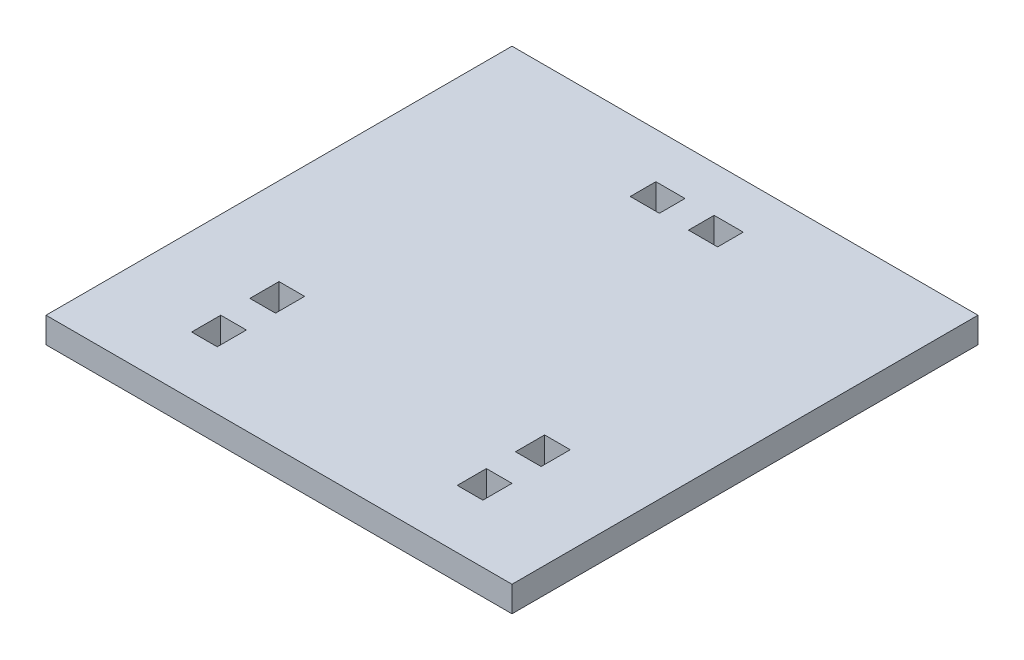
ISO-10303-21;
HEADER;
FILE_DESCRIPTION(('STEP AP214'),'2;1');
FILE_NAME('part.step','',(''),(''),'','','');
FILE_SCHEMA(('AUTOMOTIVE_DESIGN { 1 0 10303 214 1 1 1 1 }'));
ENDSEC;
DATA;
#1=APPLICATION_CONTEXT('core data for automotive mechanical design processes');
#2=APPLICATION_PROTOCOL_DEFINITION('international standard','automotive_design',2000,#1);
#3=PRODUCT_CONTEXT('',#1,'mechanical');
#4=PRODUCT('Part','Part','',(#3));
#5=PRODUCT_RELATED_PRODUCT_CATEGORY('part','',(#4));
#6=PRODUCT_DEFINITION_FORMATION('','',#4);
#7=PRODUCT_DEFINITION_CONTEXT('part definition',#1,'design');
#8=PRODUCT_DEFINITION('design','',#6,#7);
#9=PRODUCT_DEFINITION_SHAPE('','',#8);
#10=(LENGTH_UNIT() NAMED_UNIT(*) SI_UNIT(.MILLI.,.METRE.));
#11=(NAMED_UNIT(*) PLANE_ANGLE_UNIT() SI_UNIT($,.RADIAN.));
#12=(NAMED_UNIT(*) SI_UNIT($,.STERADIAN.) SOLID_ANGLE_UNIT());
#13=UNCERTAINTY_MEASURE_WITH_UNIT(LENGTH_MEASURE(1.E-05),#10,'distance_accuracy_value','');
#14=(GEOMETRIC_REPRESENTATION_CONTEXT(3) GLOBAL_UNCERTAINTY_ASSIGNED_CONTEXT((#13)) GLOBAL_UNIT_ASSIGNED_CONTEXT((#10,
#11,#12)) REPRESENTATION_CONTEXT('',''));
#15=CARTESIAN_POINT('',(0.,0.,0.));
#16=DIRECTION('',(0.,0.,1.));
#17=DIRECTION('',(1.,0.,0.));
#18=AXIS2_PLACEMENT_3D('',#15,#16,#17);
#19=CARTESIAN_POINT('',(0.,5.588,0.));
#20=DIRECTION('',(0.,-1.,0.));
#21=DIRECTION('',(0.,0.,-1.));
#22=AXIS2_PLACEMENT_3D('',#19,#20,#21);
#23=PLANE('',#22);
#24=DIRECTION('',(-1.,0.,0.));
#25=VECTOR('',#24,1.);
#26=CARTESIAN_POINT('',(82.55,5.588,-31.75));
#27=LINE('',#26,#25);
#28=CARTESIAN_POINT('',(82.55,5.588,-31.75));
#29=VERTEX_POINT('',#28);
#30=CARTESIAN_POINT('',(76.962,5.588,-31.75));
#31=VERTEX_POINT('',#30);
#32=EDGE_CURVE('E254',#29,#31,#27,.T.);
#33=ORIENTED_EDGE('',*,*,#32,.F.);
#34=DIRECTION('',(0.,0.,-1.));
#35=VECTOR('',#34,1.);
#36=CARTESIAN_POINT('',(82.55,5.588,-31.75));
#37=LINE('',#36,#35);
#38=CARTESIAN_POINT('',(82.55,5.588,-25.4));
#39=VERTEX_POINT('',#38);
#40=EDGE_CURVE('E262',#39,#29,#37,.T.);
#41=ORIENTED_EDGE('',*,*,#40,.F.);
#42=DIRECTION('',(1.,0.,0.));
#43=VECTOR('',#42,1.);
#44=CARTESIAN_POINT('',(82.55,5.588,-25.4));
#45=LINE('',#44,#43);
#46=CARTESIAN_POINT('',(76.962,5.588,-25.4));
#47=VERTEX_POINT('',#46);
#48=EDGE_CURVE('E259',#47,#39,#45,.T.);
#49=ORIENTED_EDGE('',*,*,#48,.F.);
#50=DIRECTION('',(0.,0.,1.));
#51=VECTOR('',#50,1.);
#52=CARTESIAN_POINT('',(76.962,5.588,-31.75));
#53=LINE('',#52,#51);
#54=EDGE_CURVE('E256',#31,#47,#53,.T.);
#55=ORIENTED_EDGE('',*,*,#54,.F.);
#56=EDGE_LOOP('',(#33,#41,#49,#55));
#57=FACE_BOUND('',#56,.T.);
#58=DIRECTION('',(0.,0.,1.));
#59=VECTOR('',#58,1.);
#60=CARTESIAN_POINT('',(41.275,5.588,-86.106));
#61=LINE('',#60,#59);
#62=CARTESIAN_POINT('',(41.275,5.588,-91.694));
#63=VERTEX_POINT('',#62);
#64=CARTESIAN_POINT('',(41.275,5.588,-86.106));
#65=VERTEX_POINT('',#64);
#66=EDGE_CURVE('E316',#63,#65,#61,.T.);
#67=ORIENTED_EDGE('',*,*,#66,.F.);
#68=DIRECTION('',(-1.,0.,0.));
#69=VECTOR('',#68,1.);
#70=CARTESIAN_POINT('',(41.275,5.588,-91.694));
#71=LINE('',#70,#69);
#72=CARTESIAN_POINT('',(47.625,5.588,-91.694));
#73=VERTEX_POINT('',#72);
#74=EDGE_CURVE('E324',#73,#63,#71,.T.);
#75=ORIENTED_EDGE('',*,*,#74,.F.);
#76=DIRECTION('',(0.,0.,-1.));
#77=VECTOR('',#76,1.);
#78=CARTESIAN_POINT('',(47.625,5.588,-86.106));
#79=LINE('',#78,#77);
#80=CARTESIAN_POINT('',(47.625,5.588,-86.106));
#81=VERTEX_POINT('',#80);
#82=EDGE_CURVE('E321',#81,#73,#79,.T.);
#83=ORIENTED_EDGE('',*,*,#82,.F.);
#84=DIRECTION('',(1.,0.,0.));
#85=VECTOR('',#84,1.);
#86=CARTESIAN_POINT('',(41.275,5.588,-86.106));
#87=LINE('',#86,#85);
#88=EDGE_CURVE('E318',#65,#81,#87,.T.);
#89=ORIENTED_EDGE('',*,*,#88,.F.);
#90=EDGE_LOOP('',(#67,#75,#83,#89));
#91=FACE_BOUND('',#90,.T.);
#92=DIRECTION('',(0.,0.,1.));
#93=VECTOR('',#92,1.);
#94=CARTESIAN_POINT('',(19.05,5.588,-31.75));
#95=LINE('',#94,#93);
#96=CARTESIAN_POINT('',(19.05,5.588,-31.75));
#97=VERTEX_POINT('',#96);
#98=CARTESIAN_POINT('',(19.05,5.588,-25.4));
#99=VERTEX_POINT('',#98);
#100=EDGE_CURVE('E378',#97,#99,#95,.T.);
#101=ORIENTED_EDGE('',*,*,#100,.F.);
#102=DIRECTION('',(-1.,0.,0.));
#103=VECTOR('',#102,1.);
#104=CARTESIAN_POINT('',(19.05,5.588,-31.75));
#105=LINE('',#104,#103);
#106=CARTESIAN_POINT('',(24.638,5.588,-31.75));
#107=VERTEX_POINT('',#106);
#108=EDGE_CURVE('E386',#107,#97,#105,.T.);
#109=ORIENTED_EDGE('',*,*,#108,.F.);
#110=DIRECTION('',(0.,0.,-1.));
#111=VECTOR('',#110,1.);
#112=CARTESIAN_POINT('',(24.638,5.588,-31.75));
#113=LINE('',#112,#111);
#114=CARTESIAN_POINT('',(24.638,5.588,-25.4));
#115=VERTEX_POINT('',#114);
#116=EDGE_CURVE('E383',#115,#107,#113,.T.);
#117=ORIENTED_EDGE('',*,*,#116,.F.);
#118=DIRECTION('',(1.,0.,0.));
#119=VECTOR('',#118,1.);
#120=CARTESIAN_POINT('',(19.05,5.588,-25.4));
#121=LINE('',#120,#119);
#122=EDGE_CURVE('E380',#99,#115,#121,.T.);
#123=ORIENTED_EDGE('',*,*,#122,.F.);
#124=EDGE_LOOP('',(#101,#109,#117,#123));
#125=FACE_BOUND('',#124,.T.);
#126=DIRECTION('',(0.,0.,1.));
#127=VECTOR('',#126,1.);
#128=CARTESIAN_POINT('',(0.,5.588,0.));
#129=LINE('',#128,#127);
#130=CARTESIAN_POINT('',(0.,5.588,-101.6));
#131=VERTEX_POINT('',#130);
#132=CARTESIAN_POINT('',(0.,5.588,0.));
#133=VERTEX_POINT('',#132);
#134=EDGE_CURVE('E409',#131,#133,#129,.T.);
#135=ORIENTED_EDGE('',*,*,#134,.T.);
#136=DIRECTION('',(1.,0.,0.));
#137=VECTOR('',#136,1.);
#138=CARTESIAN_POINT('',(0.,5.588,0.));
#139=LINE('',#138,#137);
#140=CARTESIAN_POINT('',(101.6,5.588,0.));
#141=VERTEX_POINT('',#140);
#142=EDGE_CURVE('E412',#133,#141,#139,.T.);
#143=ORIENTED_EDGE('',*,*,#142,.T.);
#144=DIRECTION('',(0.,0.,-1.));
#145=VECTOR('',#144,1.);
#146=CARTESIAN_POINT('',(101.6,5.588,0.));
#147=LINE('',#146,#145);
#148=CARTESIAN_POINT('',(101.6,5.588,-101.6));
#149=VERTEX_POINT('',#148);
#150=EDGE_CURVE('E415',#141,#149,#147,.T.);
#151=ORIENTED_EDGE('',*,*,#150,.T.);
#152=DIRECTION('',(-1.,0.,0.));
#153=VECTOR('',#152,1.);
#154=CARTESIAN_POINT('',(0.,5.588,-101.6));
#155=LINE('',#154,#153);
#156=EDGE_CURVE('E417',#149,#131,#155,.T.);
#157=ORIENTED_EDGE('',*,*,#156,.T.);
#158=EDGE_LOOP('',(#135,#143,#151,#157));
#159=FACE_BOUND('',#158,.T.);
#160=DIRECTION('',(0.,0.,1.));
#161=VECTOR('',#160,1.);
#162=CARTESIAN_POINT('',(19.05,5.588,-19.05));
#163=LINE('',#162,#161);
#164=CARTESIAN_POINT('',(19.05,5.588,-19.05));
#165=VERTEX_POINT('',#164);
#166=CARTESIAN_POINT('',(19.05,5.588,-12.7));
#167=VERTEX_POINT('',#166);
#168=EDGE_CURVE('E347',#165,#167,#163,.T.);
#169=ORIENTED_EDGE('',*,*,#168,.F.);
#170=DIRECTION('',(-1.,0.,0.));
#171=VECTOR('',#170,1.);
#172=CARTESIAN_POINT('',(19.05,5.588,-19.05));
#173=LINE('',#172,#171);
#174=CARTESIAN_POINT('',(24.638,5.588,-19.05));
#175=VERTEX_POINT('',#174);
#176=EDGE_CURVE('E355',#175,#165,#173,.T.);
#177=ORIENTED_EDGE('',*,*,#176,.F.);
#178=DIRECTION('',(0.,0.,-1.));
#179=VECTOR('',#178,1.);
#180=CARTESIAN_POINT('',(24.638,5.588,-19.05));
#181=LINE('',#180,#179);
#182=CARTESIAN_POINT('',(24.638,5.588,-12.7));
#183=VERTEX_POINT('',#182);
#184=EDGE_CURVE('E352',#183,#175,#181,.T.);
#185=ORIENTED_EDGE('',*,*,#184,.F.);
#186=DIRECTION('',(1.,0.,0.));
#187=VECTOR('',#186,1.);
#188=CARTESIAN_POINT('',(19.05,5.588,-12.7));
#189=LINE('',#188,#187);
#190=EDGE_CURVE('E349',#167,#183,#189,.T.);
#191=ORIENTED_EDGE('',*,*,#190,.F.);
#192=EDGE_LOOP('',(#169,#177,#185,#191));
#193=FACE_BOUND('',#192,.T.);
#194=DIRECTION('',(-1.,0.,0.));
#195=VECTOR('',#194,1.);
#196=CARTESIAN_POINT('',(82.55,5.588,-19.05));
#197=LINE('',#196,#195);
#198=CARTESIAN_POINT('',(82.55,5.588,-19.05));
#199=VERTEX_POINT('',#198);
#200=CARTESIAN_POINT('',(76.962,5.588,-19.05));
#201=VERTEX_POINT('',#200);
#202=EDGE_CURVE('E285',#199,#201,#197,.T.);
#203=ORIENTED_EDGE('',*,*,#202,.F.);
#204=DIRECTION('',(0.,0.,-1.));
#205=VECTOR('',#204,1.);
#206=CARTESIAN_POINT('',(82.55,5.588,-19.05));
#207=LINE('',#206,#205);
#208=CARTESIAN_POINT('',(82.55,5.588,-12.7));
#209=VERTEX_POINT('',#208);
#210=EDGE_CURVE('E293',#209,#199,#207,.T.);
#211=ORIENTED_EDGE('',*,*,#210,.F.);
#212=DIRECTION('',(1.,0.,0.));
#213=VECTOR('',#212,1.);
#214=CARTESIAN_POINT('',(82.55,5.588,-12.7));
#215=LINE('',#214,#213);
#216=CARTESIAN_POINT('',(76.962,5.588,-12.7));
#217=VERTEX_POINT('',#216);
#218=EDGE_CURVE('E290',#217,#209,#215,.T.);
#219=ORIENTED_EDGE('',*,*,#218,.F.);
#220=DIRECTION('',(0.,0.,1.));
#221=VECTOR('',#220,1.);
#222=CARTESIAN_POINT('',(76.962,5.588,-19.05));
#223=LINE('',#222,#221);
#224=EDGE_CURVE('E287',#201,#217,#223,.T.);
#225=ORIENTED_EDGE('',*,*,#224,.F.);
#226=EDGE_LOOP('',(#203,#211,#219,#225));
#227=FACE_BOUND('',#226,.T.);
#228=DIRECTION('',(0.,0.,1.));
#229=VECTOR('',#228,1.);
#230=CARTESIAN_POINT('',(53.975,5.588,-86.106));
#231=LINE('',#230,#229);
#232=CARTESIAN_POINT('',(53.975,5.588,-91.694));
#233=VERTEX_POINT('',#232);
#234=CARTESIAN_POINT('',(53.975,5.588,-86.106));
#235=VERTEX_POINT('',#234);
#236=EDGE_CURVE('E218',#233,#235,#231,.T.);
#237=ORIENTED_EDGE('',*,*,#236,.F.);
#238=DIRECTION('',(-1.,0.,0.));
#239=VECTOR('',#238,1.);
#240=CARTESIAN_POINT('',(53.975,5.588,-91.694));
#241=LINE('',#240,#239);
#242=CARTESIAN_POINT('',(60.325,5.588,-91.694));
#243=VERTEX_POINT('',#242);
#244=EDGE_CURVE('E240',#243,#233,#241,.T.);
#245=ORIENTED_EDGE('',*,*,#244,.F.);
#246=DIRECTION('',(0.,0.,-1.));
#247=VECTOR('',#246,1.);
#248=CARTESIAN_POINT('',(60.325,5.588,-86.106));
#249=LINE('',#248,#247);
#250=CARTESIAN_POINT('',(60.325,5.588,-86.106));
#251=VERTEX_POINT('',#250);
#252=EDGE_CURVE('E238',#251,#243,#249,.T.);
#253=ORIENTED_EDGE('',*,*,#252,.F.);
#254=DIRECTION('',(1.,0.,0.));
#255=VECTOR('',#254,1.);
#256=CARTESIAN_POINT('',(53.975,5.588,-86.106));
#257=LINE('',#256,#255);
#258=EDGE_CURVE('E226',#235,#251,#257,.T.);
#259=ORIENTED_EDGE('',*,*,#258,.F.);
#260=EDGE_LOOP('',(#237,#245,#253,#259));
#261=FACE_BOUND('',#260,.T.);
#262=ADVANCED_FACE('F33',(#57,#91,#125,#159,#193,#227,#261),#23,.F.);
#263=CARTESIAN_POINT('',(0.,0.,0.));
#264=DIRECTION('',(0.,-1.,0.));
#265=DIRECTION('',(0.,0.,-1.));
#266=AXIS2_PLACEMENT_3D('',#263,#264,#265);
#267=PLANE('',#266);
#268=DIRECTION('',(0.,0.,1.));
#269=VECTOR('',#268,1.);
#270=CARTESIAN_POINT('',(0.,0.,0.));
#271=LINE('',#270,#269);
#272=CARTESIAN_POINT('',(0.,0.,-101.6));
#273=VERTEX_POINT('',#272);
#274=CARTESIAN_POINT('',(0.,0.,0.));
#275=VERTEX_POINT('',#274);
#276=EDGE_CURVE('E408',#273,#275,#271,.T.);
#277=ORIENTED_EDGE('',*,*,#276,.F.);
#278=DIRECTION('',(-1.,0.,0.));
#279=VECTOR('',#278,1.);
#280=CARTESIAN_POINT('',(0.,0.,-101.6));
#281=LINE('',#280,#279);
#282=CARTESIAN_POINT('',(101.6,0.,-101.6));
#283=VERTEX_POINT('',#282);
#284=EDGE_CURVE('E413',#283,#273,#281,.T.);
#285=ORIENTED_EDGE('',*,*,#284,.F.);
#286=DIRECTION('',(0.,0.,-1.));
#287=VECTOR('',#286,1.);
#288=CARTESIAN_POINT('',(101.6,0.,0.));
#289=LINE('',#288,#287);
#290=CARTESIAN_POINT('',(101.6,0.,0.));
#291=VERTEX_POINT('',#290);
#292=EDGE_CURVE('E424',#291,#283,#289,.T.);
#293=ORIENTED_EDGE('',*,*,#292,.F.);
#294=DIRECTION('',(1.,0.,0.));
#295=VECTOR('',#294,1.);
#296=CARTESIAN_POINT('',(0.,0.,0.));
#297=LINE('',#296,#295);
#298=EDGE_CURVE('E422',#275,#291,#297,.T.);
#299=ORIENTED_EDGE('',*,*,#298,.F.);
#300=EDGE_LOOP('',(#277,#285,#293,#299));
#301=FACE_BOUND('',#300,.T.);
#302=DIRECTION('',(-1.,0.,0.));
#303=VECTOR('',#302,1.);
#304=CARTESIAN_POINT('',(19.05,0.,-31.75));
#305=LINE('',#304,#303);
#306=CARTESIAN_POINT('',(24.638,0.,-31.75));
#307=VERTEX_POINT('',#306);
#308=CARTESIAN_POINT('',(19.05,0.,-31.75));
#309=VERTEX_POINT('',#308);
#310=EDGE_CURVE('E381',#307,#309,#305,.T.);
#311=ORIENTED_EDGE('',*,*,#310,.T.);
#312=DIRECTION('',(0.,0.,1.));
#313=VECTOR('',#312,1.);
#314=CARTESIAN_POINT('',(19.05,0.,-31.75));
#315=LINE('',#314,#313);
#316=CARTESIAN_POINT('',(19.05,0.,-25.4));
#317=VERTEX_POINT('',#316);
#318=EDGE_CURVE('E377',#309,#317,#315,.T.);
#319=ORIENTED_EDGE('',*,*,#318,.T.);
#320=DIRECTION('',(1.,0.,0.));
#321=VECTOR('',#320,1.);
#322=CARTESIAN_POINT('',(19.05,0.,-25.4));
#323=LINE('',#322,#321);
#324=CARTESIAN_POINT('',(24.638,0.,-25.4));
#325=VERTEX_POINT('',#324);
#326=EDGE_CURVE('E391',#317,#325,#323,.T.);
#327=ORIENTED_EDGE('',*,*,#326,.T.);
#328=DIRECTION('',(0.,0.,-1.));
#329=VECTOR('',#328,1.);
#330=CARTESIAN_POINT('',(24.638,0.,-31.75));
#331=LINE('',#330,#329);
#332=EDGE_CURVE('E394',#325,#307,#331,.T.);
#333=ORIENTED_EDGE('',*,*,#332,.T.);
#334=EDGE_LOOP('',(#311,#319,#327,#333));
#335=FACE_BOUND('',#334,.T.);
#336=DIRECTION('',(-1.,0.,0.));
#337=VECTOR('',#336,1.);
#338=CARTESIAN_POINT('',(19.05,0.,-19.05));
#339=LINE('',#338,#337);
#340=CARTESIAN_POINT('',(24.638,0.,-19.05));
#341=VERTEX_POINT('',#340);
#342=CARTESIAN_POINT('',(19.05,0.,-19.05));
#343=VERTEX_POINT('',#342);
#344=EDGE_CURVE('E350',#341,#343,#339,.T.);
#345=ORIENTED_EDGE('',*,*,#344,.T.);
#346=DIRECTION('',(0.,0.,1.));
#347=VECTOR('',#346,1.);
#348=CARTESIAN_POINT('',(19.05,0.,-19.05));
#349=LINE('',#348,#347);
#350=CARTESIAN_POINT('',(19.05,0.,-12.7));
#351=VERTEX_POINT('',#350);
#352=EDGE_CURVE('E346',#343,#351,#349,.T.);
#353=ORIENTED_EDGE('',*,*,#352,.T.);
#354=DIRECTION('',(1.,0.,0.));
#355=VECTOR('',#354,1.);
#356=CARTESIAN_POINT('',(19.05,0.,-12.7));
#357=LINE('',#356,#355);
#358=CARTESIAN_POINT('',(24.638,0.,-12.7));
#359=VERTEX_POINT('',#358);
#360=EDGE_CURVE('E360',#351,#359,#357,.T.);
#361=ORIENTED_EDGE('',*,*,#360,.T.);
#362=DIRECTION('',(0.,0.,-1.));
#363=VECTOR('',#362,1.);
#364=CARTESIAN_POINT('',(24.638,0.,-19.05));
#365=LINE('',#364,#363);
#366=EDGE_CURVE('E363',#359,#341,#365,.T.);
#367=ORIENTED_EDGE('',*,*,#366,.T.);
#368=EDGE_LOOP('',(#345,#353,#361,#367));
#369=FACE_BOUND('',#368,.T.);
#370=DIRECTION('',(-1.,0.,0.));
#371=VECTOR('',#370,1.);
#372=CARTESIAN_POINT('',(41.275,0.,-91.694));
#373=LINE('',#372,#371);
#374=CARTESIAN_POINT('',(47.625,0.,-91.694));
#375=VERTEX_POINT('',#374);
#376=CARTESIAN_POINT('',(41.275,0.,-91.694));
#377=VERTEX_POINT('',#376);
#378=EDGE_CURVE('E319',#375,#377,#373,.T.);
#379=ORIENTED_EDGE('',*,*,#378,.T.);
#380=DIRECTION('',(0.,0.,1.));
#381=VECTOR('',#380,1.);
#382=CARTESIAN_POINT('',(41.275,0.,-86.106));
#383=LINE('',#382,#381);
#384=CARTESIAN_POINT('',(41.275,0.,-86.106));
#385=VERTEX_POINT('',#384);
#386=EDGE_CURVE('E315',#377,#385,#383,.T.);
#387=ORIENTED_EDGE('',*,*,#386,.T.);
#388=DIRECTION('',(1.,0.,0.));
#389=VECTOR('',#388,1.);
#390=CARTESIAN_POINT('',(41.275,0.,-86.106));
#391=LINE('',#390,#389);
#392=CARTESIAN_POINT('',(47.625,0.,-86.106));
#393=VERTEX_POINT('',#392);
#394=EDGE_CURVE('E329',#385,#393,#391,.T.);
#395=ORIENTED_EDGE('',*,*,#394,.T.);
#396=DIRECTION('',(0.,0.,-1.));
#397=VECTOR('',#396,1.);
#398=CARTESIAN_POINT('',(47.625,0.,-86.106));
#399=LINE('',#398,#397);
#400=EDGE_CURVE('E332',#393,#375,#399,.T.);
#401=ORIENTED_EDGE('',*,*,#400,.T.);
#402=EDGE_LOOP('',(#379,#387,#395,#401));
#403=FACE_BOUND('',#402,.T.);
#404=DIRECTION('',(0.,0.,-1.));
#405=VECTOR('',#404,1.);
#406=CARTESIAN_POINT('',(82.55,0.,-19.05));
#407=LINE('',#406,#405);
#408=CARTESIAN_POINT('',(82.55,0.,-12.7));
#409=VERTEX_POINT('',#408);
#410=CARTESIAN_POINT('',(82.55,0.,-19.05));
#411=VERTEX_POINT('',#410);
#412=EDGE_CURVE('E288',#409,#411,#407,.T.);
#413=ORIENTED_EDGE('',*,*,#412,.T.);
#414=DIRECTION('',(-1.,0.,0.));
#415=VECTOR('',#414,1.);
#416=CARTESIAN_POINT('',(82.55,0.,-19.05));
#417=LINE('',#416,#415);
#418=CARTESIAN_POINT('',(76.962,0.,-19.05));
#419=VERTEX_POINT('',#418);
#420=EDGE_CURVE('E284',#411,#419,#417,.T.);
#421=ORIENTED_EDGE('',*,*,#420,.T.);
#422=DIRECTION('',(0.,0.,1.));
#423=VECTOR('',#422,1.);
#424=CARTESIAN_POINT('',(76.962,0.,-19.05));
#425=LINE('',#424,#423);
#426=CARTESIAN_POINT('',(76.962,0.,-12.7));
#427=VERTEX_POINT('',#426);
#428=EDGE_CURVE('E298',#419,#427,#425,.T.);
#429=ORIENTED_EDGE('',*,*,#428,.T.);
#430=DIRECTION('',(1.,0.,0.));
#431=VECTOR('',#430,1.);
#432=CARTESIAN_POINT('',(82.55,0.,-12.7));
#433=LINE('',#432,#431);
#434=EDGE_CURVE('E301',#427,#409,#433,.T.);
#435=ORIENTED_EDGE('',*,*,#434,.T.);
#436=EDGE_LOOP('',(#413,#421,#429,#435));
#437=FACE_BOUND('',#436,.T.);
#438=DIRECTION('',(0.,0.,-1.));
#439=VECTOR('',#438,1.);
#440=CARTESIAN_POINT('',(82.55,0.,-31.75));
#441=LINE('',#440,#439);
#442=CARTESIAN_POINT('',(82.55,0.,-25.4));
#443=VERTEX_POINT('',#442);
#444=CARTESIAN_POINT('',(82.55,0.,-31.75));
#445=VERTEX_POINT('',#444);
#446=EDGE_CURVE('E257',#443,#445,#441,.T.);
#447=ORIENTED_EDGE('',*,*,#446,.T.);
#448=DIRECTION('',(-1.,0.,0.));
#449=VECTOR('',#448,1.);
#450=CARTESIAN_POINT('',(82.55,0.,-31.75));
#451=LINE('',#450,#449);
#452=CARTESIAN_POINT('',(76.962,0.,-31.75));
#453=VERTEX_POINT('',#452);
#454=EDGE_CURVE('E234',#445,#453,#451,.T.);
#455=ORIENTED_EDGE('',*,*,#454,.T.);
#456=DIRECTION('',(0.,0.,1.));
#457=VECTOR('',#456,1.);
#458=CARTESIAN_POINT('',(76.962,0.,-31.75));
#459=LINE('',#458,#457);
#460=CARTESIAN_POINT('',(76.962,0.,-25.4));
#461=VERTEX_POINT('',#460);
#462=EDGE_CURVE('E267',#453,#461,#459,.T.);
#463=ORIENTED_EDGE('',*,*,#462,.T.);
#464=DIRECTION('',(1.,0.,0.));
#465=VECTOR('',#464,1.);
#466=CARTESIAN_POINT('',(82.55,0.,-25.4));
#467=LINE('',#466,#465);
#468=EDGE_CURVE('E270',#461,#443,#467,.T.);
#469=ORIENTED_EDGE('',*,*,#468,.T.);
#470=EDGE_LOOP('',(#447,#455,#463,#469));
#471=FACE_BOUND('',#470,.T.);
#472=DIRECTION('',(-1.,0.,0.));
#473=VECTOR('',#472,1.);
#474=CARTESIAN_POINT('',(53.975,0.,-91.694));
#475=LINE('',#474,#473);
#476=CARTESIAN_POINT('',(60.325,0.,-91.694));
#477=VERTEX_POINT('',#476);
#478=CARTESIAN_POINT('',(53.975,0.,-91.694));
#479=VERTEX_POINT('',#478);
#480=EDGE_CURVE('E227',#477,#479,#475,.T.);
#481=ORIENTED_EDGE('',*,*,#480,.T.);
#482=DIRECTION('',(0.,0.,1.));
#483=VECTOR('',#482,1.);
#484=CARTESIAN_POINT('',(53.975,0.,-86.106));
#485=LINE('',#484,#483);
#486=CARTESIAN_POINT('',(53.975,0.,-86.106));
#487=VERTEX_POINT('',#486);
#488=EDGE_CURVE('E56',#479,#487,#485,.T.);
#489=ORIENTED_EDGE('',*,*,#488,.T.);
#490=DIRECTION('',(1.,0.,0.));
#491=VECTOR('',#490,1.);
#492=CARTESIAN_POINT('',(53.975,0.,-86.106));
#493=LINE('',#492,#491);
#494=CARTESIAN_POINT('',(60.325,0.,-86.106));
#495=VERTEX_POINT('',#494);
#496=EDGE_CURVE('E233',#487,#495,#493,.T.);
#497=ORIENTED_EDGE('',*,*,#496,.T.);
#498=DIRECTION('',(0.,0.,-1.));
#499=VECTOR('',#498,1.);
#500=CARTESIAN_POINT('',(60.325,0.,-86.106));
#501=LINE('',#500,#499);
#502=EDGE_CURVE('E246',#495,#477,#501,.T.);
#503=ORIENTED_EDGE('',*,*,#502,.T.);
#504=EDGE_LOOP('',(#481,#489,#497,#503));
#505=FACE_BOUND('',#504,.T.);
#506=ADVANCED_FACE('F442',(#301,#335,#369,#403,#437,#471,#505),#267,.T.);
#507=CARTESIAN_POINT('',(0.,5.588,0.));
#508=DIRECTION('',(1.,0.,0.));
#509=DIRECTION('',(0.,0.,-1.));
#510=AXIS2_PLACEMENT_3D('',#507,#508,#509);
#511=PLANE('',#510);
#512=ORIENTED_EDGE('',*,*,#276,.T.);
#513=DIRECTION('',(0.,-1.,0.));
#514=VECTOR('',#513,1.);
#515=CARTESIAN_POINT('',(0.,5.588,0.));
#516=LINE('',#515,#514);
#517=EDGE_CURVE('E11',#133,#275,#516,.T.);
#518=ORIENTED_EDGE('',*,*,#517,.F.);
#519=ORIENTED_EDGE('',*,*,#134,.F.);
#520=DIRECTION('',(0.,-1.,0.));
#521=VECTOR('',#520,1.);
#522=CARTESIAN_POINT('',(0.,5.588,-101.6));
#523=LINE('',#522,#521);
#524=EDGE_CURVE('E419',#131,#273,#523,.T.);
#525=ORIENTED_EDGE('',*,*,#524,.T.);
#526=EDGE_LOOP('',(#512,#518,#519,#525));
#527=FACE_BOUND('',#526,.T.);
#528=ADVANCED_FACE('F35',(#527),#511,.F.);
#529=CARTESIAN_POINT('',(0.,5.588,0.));
#530=DIRECTION('',(0.,0.,-1.));
#531=DIRECTION('',(-1.,0.,0.));
#532=AXIS2_PLACEMENT_3D('',#529,#530,#531);
#533=PLANE('',#532);
#534=ORIENTED_EDGE('',*,*,#298,.T.);
#535=DIRECTION('',(0.,-1.,0.));
#536=VECTOR('',#535,1.);
#537=CARTESIAN_POINT('',(101.6,5.588,0.));
#538=LINE('',#537,#536);
#539=EDGE_CURVE('E41',#141,#291,#538,.T.);
#540=ORIENTED_EDGE('',*,*,#539,.F.);
#541=ORIENTED_EDGE('',*,*,#142,.F.);
#542=ORIENTED_EDGE('',*,*,#517,.T.);
#543=EDGE_LOOP('',(#534,#540,#541,#542));
#544=FACE_BOUND('',#543,.T.);
#545=ADVANCED_FACE('F453',(#544),#533,.F.);
#546=CARTESIAN_POINT('',(101.6,5.588,0.));
#547=DIRECTION('',(-1.,0.,0.));
#548=DIRECTION('',(0.,0.,1.));
#549=AXIS2_PLACEMENT_3D('',#546,#547,#548);
#550=PLANE('',#549);
#551=ORIENTED_EDGE('',*,*,#292,.T.);
#552=DIRECTION('',(0.,-1.,0.));
#553=VECTOR('',#552,1.);
#554=CARTESIAN_POINT('',(101.6,5.588,-101.6));
#555=LINE('',#554,#553);
#556=EDGE_CURVE('E429',#149,#283,#555,.T.);
#557=ORIENTED_EDGE('',*,*,#556,.F.);
#558=ORIENTED_EDGE('',*,*,#150,.F.);
#559=ORIENTED_EDGE('',*,*,#539,.T.);
#560=EDGE_LOOP('',(#551,#557,#558,#559));
#561=FACE_BOUND('',#560,.T.);
#562=ADVANCED_FACE('F436',(#561),#550,.F.);
#563=CARTESIAN_POINT('',(0.,5.588,-101.6));
#564=DIRECTION('',(0.,0.,1.));
#565=DIRECTION('',(1.,0.,0.));
#566=AXIS2_PLACEMENT_3D('',#563,#564,#565);
#567=PLANE('',#566);
#568=ORIENTED_EDGE('',*,*,#284,.T.);
#569=ORIENTED_EDGE('',*,*,#524,.F.);
#570=ORIENTED_EDGE('',*,*,#156,.F.);
#571=ORIENTED_EDGE('',*,*,#556,.T.);
#572=EDGE_LOOP('',(#568,#569,#570,#571));
#573=FACE_BOUND('',#572,.T.);
#574=ADVANCED_FACE('F446',(#573),#567,.F.);
#575=CARTESIAN_POINT('',(19.05,5.588,-31.75));
#576=DIRECTION('',(1.,0.,0.));
#577=DIRECTION('',(0.,0.,-1.));
#578=AXIS2_PLACEMENT_3D('',#575,#576,#577);
#579=PLANE('',#578);
#580=ORIENTED_EDGE('',*,*,#318,.F.);
#581=DIRECTION('',(0.,-1.,0.));
#582=VECTOR('',#581,1.);
#583=CARTESIAN_POINT('',(19.05,5.588,-31.75));
#584=LINE('',#583,#582);
#585=EDGE_CURVE('E388',#97,#309,#584,.T.);
#586=ORIENTED_EDGE('',*,*,#585,.F.);
#587=ORIENTED_EDGE('',*,*,#100,.T.);
#588=DIRECTION('',(0.,-1.,0.));
#589=VECTOR('',#588,1.);
#590=CARTESIAN_POINT('',(19.05,5.588,-25.4));
#591=LINE('',#590,#589);
#592=EDGE_CURVE('E405',#99,#317,#591,.T.);
#593=ORIENTED_EDGE('',*,*,#592,.T.);
#594=EDGE_LOOP('',(#580,#586,#587,#593));
#595=FACE_BOUND('',#594,.T.);
#596=ADVANCED_FACE('F470',(#595),#579,.T.);
#597=CARTESIAN_POINT('',(19.05,5.588,-25.4));
#598=DIRECTION('',(0.,0.,-1.));
#599=DIRECTION('',(-1.,0.,0.));
#600=AXIS2_PLACEMENT_3D('',#597,#598,#599);
#601=PLANE('',#600);
#602=ORIENTED_EDGE('',*,*,#326,.F.);
#603=ORIENTED_EDGE('',*,*,#592,.F.);
#604=ORIENTED_EDGE('',*,*,#122,.T.);
#605=DIRECTION('',(0.,-1.,0.));
#606=VECTOR('',#605,1.);
#607=CARTESIAN_POINT('',(24.638,5.588,-25.4));
#608=LINE('',#607,#606);
#609=EDGE_CURVE('E403',#115,#325,#608,.T.);
#610=ORIENTED_EDGE('',*,*,#609,.T.);
#611=EDGE_LOOP('',(#602,#603,#604,#610));
#612=FACE_BOUND('',#611,.T.);
#613=ADVANCED_FACE('F477',(#612),#601,.T.);
#614=CARTESIAN_POINT('',(24.638,5.588,-31.75));
#615=DIRECTION('',(-1.,0.,0.));
#616=DIRECTION('',(0.,0.,1.));
#617=AXIS2_PLACEMENT_3D('',#614,#615,#616);
#618=PLANE('',#617);
#619=ORIENTED_EDGE('',*,*,#332,.F.);
#620=ORIENTED_EDGE('',*,*,#609,.F.);
#621=ORIENTED_EDGE('',*,*,#116,.T.);
#622=DIRECTION('',(0.,-1.,0.));
#623=VECTOR('',#622,1.);
#624=CARTESIAN_POINT('',(24.638,5.588,-31.75));
#625=LINE('',#624,#623);
#626=EDGE_CURVE('E401',#107,#307,#625,.T.);
#627=ORIENTED_EDGE('',*,*,#626,.T.);
#628=EDGE_LOOP('',(#619,#620,#621,#627));
#629=FACE_BOUND('',#628,.T.);
#630=ADVANCED_FACE('F482',(#629),#618,.T.);
#631=CARTESIAN_POINT('',(19.05,5.588,-31.75));
#632=DIRECTION('',(0.,0.,1.));
#633=DIRECTION('',(1.,0.,0.));
#634=AXIS2_PLACEMENT_3D('',#631,#632,#633);
#635=PLANE('',#634);
#636=ORIENTED_EDGE('',*,*,#310,.F.);
#637=ORIENTED_EDGE('',*,*,#626,.F.);
#638=ORIENTED_EDGE('',*,*,#108,.T.);
#639=ORIENTED_EDGE('',*,*,#585,.T.);
#640=EDGE_LOOP('',(#636,#637,#638,#639));
#641=FACE_BOUND('',#640,.T.);
#642=ADVANCED_FACE('F489',(#641),#635,.T.);
#643=CARTESIAN_POINT('',(19.05,5.588,-19.05));
#644=DIRECTION('',(1.,0.,0.));
#645=DIRECTION('',(0.,0.,-1.));
#646=AXIS2_PLACEMENT_3D('',#643,#644,#645);
#647=PLANE('',#646);
#648=ORIENTED_EDGE('',*,*,#352,.F.);
#649=DIRECTION('',(0.,-1.,0.));
#650=VECTOR('',#649,1.);
#651=CARTESIAN_POINT('',(19.05,5.588,-19.05));
#652=LINE('',#651,#650);
#653=EDGE_CURVE('E357',#165,#343,#652,.T.);
#654=ORIENTED_EDGE('',*,*,#653,.F.);
#655=ORIENTED_EDGE('',*,*,#168,.T.);
#656=DIRECTION('',(0.,-1.,0.));
#657=VECTOR('',#656,1.);
#658=CARTESIAN_POINT('',(19.05,5.588,-12.7));
#659=LINE('',#658,#657);
#660=EDGE_CURVE('E374',#167,#351,#659,.T.);
#661=ORIENTED_EDGE('',*,*,#660,.T.);
#662=EDGE_LOOP('',(#648,#654,#655,#661));
#663=FACE_BOUND('',#662,.T.);
#664=ADVANCED_FACE('F503',(#663),#647,.T.);
#665=CARTESIAN_POINT('',(19.05,5.588,-12.7));
#666=DIRECTION('',(0.,0.,-1.));
#667=DIRECTION('',(-1.,0.,0.));
#668=AXIS2_PLACEMENT_3D('',#665,#666,#667);
#669=PLANE('',#668);
#670=ORIENTED_EDGE('',*,*,#360,.F.);
#671=ORIENTED_EDGE('',*,*,#660,.F.);
#672=ORIENTED_EDGE('',*,*,#190,.T.);
#673=DIRECTION('',(0.,-1.,0.));
#674=VECTOR('',#673,1.);
#675=CARTESIAN_POINT('',(24.638,5.588,-12.7));
#676=LINE('',#675,#674);
#677=EDGE_CURVE('E372',#183,#359,#676,.T.);
#678=ORIENTED_EDGE('',*,*,#677,.T.);
#679=EDGE_LOOP('',(#670,#671,#672,#678));
#680=FACE_BOUND('',#679,.T.);
#681=ADVANCED_FACE('F508',(#680),#669,.T.);
#682=CARTESIAN_POINT('',(24.638,5.588,-19.05));
#683=DIRECTION('',(-1.,0.,0.));
#684=DIRECTION('',(0.,0.,1.));
#685=AXIS2_PLACEMENT_3D('',#682,#683,#684);
#686=PLANE('',#685);
#687=ORIENTED_EDGE('',*,*,#366,.F.);
#688=ORIENTED_EDGE('',*,*,#677,.F.);
#689=ORIENTED_EDGE('',*,*,#184,.T.);
#690=DIRECTION('',(0.,-1.,0.));
#691=VECTOR('',#690,1.);
#692=CARTESIAN_POINT('',(24.638,5.588,-19.05));
#693=LINE('',#692,#691);
#694=EDGE_CURVE('E370',#175,#341,#693,.T.);
#695=ORIENTED_EDGE('',*,*,#694,.T.);
#696=EDGE_LOOP('',(#687,#688,#689,#695));
#697=FACE_BOUND('',#696,.T.);
#698=ADVANCED_FACE('F512',(#697),#686,.T.);
#699=CARTESIAN_POINT('',(19.05,5.588,-19.05));
#700=DIRECTION('',(0.,0.,1.));
#701=DIRECTION('',(1.,0.,0.));
#702=AXIS2_PLACEMENT_3D('',#699,#700,#701);
#703=PLANE('',#702);
#704=ORIENTED_EDGE('',*,*,#344,.F.);
#705=ORIENTED_EDGE('',*,*,#694,.F.);
#706=ORIENTED_EDGE('',*,*,#176,.T.);
#707=ORIENTED_EDGE('',*,*,#653,.T.);
#708=EDGE_LOOP('',(#704,#705,#706,#707));
#709=FACE_BOUND('',#708,.T.);
#710=ADVANCED_FACE('F516',(#709),#703,.T.);
#711=CARTESIAN_POINT('',(41.275,5.588,-86.106));
#712=DIRECTION('',(1.,0.,0.));
#713=DIRECTION('',(0.,0.,-1.));
#714=AXIS2_PLACEMENT_3D('',#711,#712,#713);
#715=PLANE('',#714);
#716=ORIENTED_EDGE('',*,*,#386,.F.);
#717=DIRECTION('',(0.,-1.,0.));
#718=VECTOR('',#717,1.);
#719=CARTESIAN_POINT('',(41.275,5.588,-91.694));
#720=LINE('',#719,#718);
#721=EDGE_CURVE('E326',#63,#377,#720,.T.);
#722=ORIENTED_EDGE('',*,*,#721,.F.);
#723=ORIENTED_EDGE('',*,*,#66,.T.);
#724=DIRECTION('',(0.,-1.,0.));
#725=VECTOR('',#724,1.);
#726=CARTESIAN_POINT('',(41.275,5.588,-86.106));
#727=LINE('',#726,#725);
#728=EDGE_CURVE('E343',#65,#385,#727,.T.);
#729=ORIENTED_EDGE('',*,*,#728,.T.);
#730=EDGE_LOOP('',(#716,#722,#723,#729));
#731=FACE_BOUND('',#730,.T.);
#732=ADVANCED_FACE('F520',(#731),#715,.T.);
#733=CARTESIAN_POINT('',(41.275,5.588,-86.106));
#734=DIRECTION('',(0.,0.,-1.));
#735=DIRECTION('',(-1.,0.,0.));
#736=AXIS2_PLACEMENT_3D('',#733,#734,#735);
#737=PLANE('',#736);
#738=ORIENTED_EDGE('',*,*,#394,.F.);
#739=ORIENTED_EDGE('',*,*,#728,.F.);
#740=ORIENTED_EDGE('',*,*,#88,.T.);
#741=DIRECTION('',(0.,-1.,0.));
#742=VECTOR('',#741,1.);
#743=CARTESIAN_POINT('',(47.625,5.588,-86.106));
#744=LINE('',#743,#742);
#745=EDGE_CURVE('E341',#81,#393,#744,.T.);
#746=ORIENTED_EDGE('',*,*,#745,.T.);
#747=EDGE_LOOP('',(#738,#739,#740,#746));
#748=FACE_BOUND('',#747,.T.);
#749=ADVANCED_FACE('F524',(#748),#737,.T.);
#750=CARTESIAN_POINT('',(47.625,5.588,-86.106));
#751=DIRECTION('',(-1.,0.,0.));
#752=DIRECTION('',(0.,0.,1.));
#753=AXIS2_PLACEMENT_3D('',#750,#751,#752);
#754=PLANE('',#753);
#755=ORIENTED_EDGE('',*,*,#400,.F.);
#756=ORIENTED_EDGE('',*,*,#745,.F.);
#757=ORIENTED_EDGE('',*,*,#82,.T.);
#758=DIRECTION('',(0.,-1.,0.));
#759=VECTOR('',#758,1.);
#760=CARTESIAN_POINT('',(47.625,5.588,-91.694));
#761=LINE('',#760,#759);
#762=EDGE_CURVE('E339',#73,#375,#761,.T.);
#763=ORIENTED_EDGE('',*,*,#762,.T.);
#764=EDGE_LOOP('',(#755,#756,#757,#763));
#765=FACE_BOUND('',#764,.T.);
#766=ADVANCED_FACE('F528',(#765),#754,.T.);
#767=CARTESIAN_POINT('',(41.275,5.588,-91.694));
#768=DIRECTION('',(0.,0.,1.));
#769=DIRECTION('',(1.,0.,0.));
#770=AXIS2_PLACEMENT_3D('',#767,#768,#769);
#771=PLANE('',#770);
#772=ORIENTED_EDGE('',*,*,#378,.F.);
#773=ORIENTED_EDGE('',*,*,#762,.F.);
#774=ORIENTED_EDGE('',*,*,#74,.T.);
#775=ORIENTED_EDGE('',*,*,#721,.T.);
#776=EDGE_LOOP('',(#772,#773,#774,#775));
#777=FACE_BOUND('',#776,.T.);
#778=ADVANCED_FACE('F532',(#777),#771,.T.);
#779=CARTESIAN_POINT('',(82.55,5.588,-19.05));
#780=DIRECTION('',(0.,0.,1.));
#781=DIRECTION('',(1.,0.,0.));
#782=AXIS2_PLACEMENT_3D('',#779,#780,#781);
#783=PLANE('',#782);
#784=ORIENTED_EDGE('',*,*,#420,.F.);
#785=DIRECTION('',(0.,-1.,0.));
#786=VECTOR('',#785,1.);
#787=CARTESIAN_POINT('',(82.55,5.588,-19.05));
#788=LINE('',#787,#786);
#789=EDGE_CURVE('E295',#199,#411,#788,.T.);
#790=ORIENTED_EDGE('',*,*,#789,.F.);
#791=ORIENTED_EDGE('',*,*,#202,.T.);
#792=DIRECTION('',(0.,-1.,0.));
#793=VECTOR('',#792,1.);
#794=CARTESIAN_POINT('',(76.962,5.588,-19.05));
#795=LINE('',#794,#793);
#796=EDGE_CURVE('E312',#201,#419,#795,.T.);
#797=ORIENTED_EDGE('',*,*,#796,.T.);
#798=EDGE_LOOP('',(#784,#790,#791,#797));
#799=FACE_BOUND('',#798,.T.);
#800=ADVANCED_FACE('F536',(#799),#783,.T.);
#801=CARTESIAN_POINT('',(76.962,5.588,-19.05));
#802=DIRECTION('',(1.,0.,0.));
#803=DIRECTION('',(0.,0.,-1.));
#804=AXIS2_PLACEMENT_3D('',#801,#802,#803);
#805=PLANE('',#804);
#806=ORIENTED_EDGE('',*,*,#428,.F.);
#807=ORIENTED_EDGE('',*,*,#796,.F.);
#808=ORIENTED_EDGE('',*,*,#224,.T.);
#809=DIRECTION('',(0.,-1.,0.));
#810=VECTOR('',#809,1.);
#811=CARTESIAN_POINT('',(76.962,5.588,-12.7));
#812=LINE('',#811,#810);
#813=EDGE_CURVE('E310',#217,#427,#812,.T.);
#814=ORIENTED_EDGE('',*,*,#813,.T.);
#815=EDGE_LOOP('',(#806,#807,#808,#814));
#816=FACE_BOUND('',#815,.T.);
#817=ADVANCED_FACE('F540',(#816),#805,.T.);
#818=CARTESIAN_POINT('',(82.55,5.588,-12.7));
#819=DIRECTION('',(0.,0.,-1.));
#820=DIRECTION('',(-1.,0.,0.));
#821=AXIS2_PLACEMENT_3D('',#818,#819,#820);
#822=PLANE('',#821);
#823=ORIENTED_EDGE('',*,*,#434,.F.);
#824=ORIENTED_EDGE('',*,*,#813,.F.);
#825=ORIENTED_EDGE('',*,*,#218,.T.);
#826=DIRECTION('',(0.,-1.,0.));
#827=VECTOR('',#826,1.);
#828=CARTESIAN_POINT('',(82.55,5.588,-12.7));
#829=LINE('',#828,#827);
#830=EDGE_CURVE('E308',#209,#409,#829,.T.);
#831=ORIENTED_EDGE('',*,*,#830,.T.);
#832=EDGE_LOOP('',(#823,#824,#825,#831));
#833=FACE_BOUND('',#832,.T.);
#834=ADVANCED_FACE('F544',(#833),#822,.T.);
#835=CARTESIAN_POINT('',(82.55,5.588,-19.05));
#836=DIRECTION('',(-1.,0.,0.));
#837=DIRECTION('',(0.,0.,1.));
#838=AXIS2_PLACEMENT_3D('',#835,#836,#837);
#839=PLANE('',#838);
#840=ORIENTED_EDGE('',*,*,#412,.F.);
#841=ORIENTED_EDGE('',*,*,#830,.F.);
#842=ORIENTED_EDGE('',*,*,#210,.T.);
#843=ORIENTED_EDGE('',*,*,#789,.T.);
#844=EDGE_LOOP('',(#840,#841,#842,#843));
#845=FACE_BOUND('',#844,.T.);
#846=ADVANCED_FACE('F548',(#845),#839,.T.);
#847=CARTESIAN_POINT('',(82.55,5.588,-31.75));
#848=DIRECTION('',(0.,0.,1.));
#849=DIRECTION('',(1.,0.,0.));
#850=AXIS2_PLACEMENT_3D('',#847,#848,#849);
#851=PLANE('',#850);
#852=ORIENTED_EDGE('',*,*,#454,.F.);
#853=DIRECTION('',(0.,-1.,0.));
#854=VECTOR('',#853,1.);
#855=CARTESIAN_POINT('',(82.55,5.588,-31.75));
#856=LINE('',#855,#854);
#857=EDGE_CURVE('E264',#29,#445,#856,.T.);
#858=ORIENTED_EDGE('',*,*,#857,.F.);
#859=ORIENTED_EDGE('',*,*,#32,.T.);
#860=DIRECTION('',(0.,-1.,0.));
#861=VECTOR('',#860,1.);
#862=CARTESIAN_POINT('',(76.962,5.588,-31.75));
#863=LINE('',#862,#861);
#864=EDGE_CURVE('E281',#31,#453,#863,.T.);
#865=ORIENTED_EDGE('',*,*,#864,.T.);
#866=EDGE_LOOP('',(#852,#858,#859,#865));
#867=FACE_BOUND('',#866,.T.);
#868=ADVANCED_FACE('F552',(#867),#851,.T.);
#869=CARTESIAN_POINT('',(76.962,5.588,-31.75));
#870=DIRECTION('',(1.,0.,0.));
#871=DIRECTION('',(0.,0.,-1.));
#872=AXIS2_PLACEMENT_3D('',#869,#870,#871);
#873=PLANE('',#872);
#874=ORIENTED_EDGE('',*,*,#462,.F.);
#875=ORIENTED_EDGE('',*,*,#864,.F.);
#876=ORIENTED_EDGE('',*,*,#54,.T.);
#877=DIRECTION('',(0.,-1.,0.));
#878=VECTOR('',#877,1.);
#879=CARTESIAN_POINT('',(76.962,5.588,-25.4));
#880=LINE('',#879,#878);
#881=EDGE_CURVE('E279',#47,#461,#880,.T.);
#882=ORIENTED_EDGE('',*,*,#881,.T.);
#883=EDGE_LOOP('',(#874,#875,#876,#882));
#884=FACE_BOUND('',#883,.T.);
#885=ADVANCED_FACE('F556',(#884),#873,.T.);
#886=CARTESIAN_POINT('',(82.55,5.588,-25.4));
#887=DIRECTION('',(0.,0.,-1.));
#888=DIRECTION('',(-1.,0.,0.));
#889=AXIS2_PLACEMENT_3D('',#886,#887,#888);
#890=PLANE('',#889);
#891=ORIENTED_EDGE('',*,*,#468,.F.);
#892=ORIENTED_EDGE('',*,*,#881,.F.);
#893=ORIENTED_EDGE('',*,*,#48,.T.);
#894=DIRECTION('',(0.,-1.,0.));
#895=VECTOR('',#894,1.);
#896=CARTESIAN_POINT('',(82.55,5.588,-25.4));
#897=LINE('',#896,#895);
#898=EDGE_CURVE('E277',#39,#443,#897,.T.);
#899=ORIENTED_EDGE('',*,*,#898,.T.);
#900=EDGE_LOOP('',(#891,#892,#893,#899));
#901=FACE_BOUND('',#900,.T.);
#902=ADVANCED_FACE('F560',(#901),#890,.T.);
#903=CARTESIAN_POINT('',(82.55,5.588,-31.75));
#904=DIRECTION('',(-1.,0.,0.));
#905=DIRECTION('',(0.,0.,1.));
#906=AXIS2_PLACEMENT_3D('',#903,#904,#905);
#907=PLANE('',#906);
#908=ORIENTED_EDGE('',*,*,#446,.F.);
#909=ORIENTED_EDGE('',*,*,#898,.F.);
#910=ORIENTED_EDGE('',*,*,#40,.T.);
#911=ORIENTED_EDGE('',*,*,#857,.T.);
#912=EDGE_LOOP('',(#908,#909,#910,#911));
#913=FACE_BOUND('',#912,.T.);
#914=ADVANCED_FACE('F564',(#913),#907,.T.);
#915=CARTESIAN_POINT('',(53.975,5.588,-86.106));
#916=DIRECTION('',(1.,0.,0.));
#917=DIRECTION('',(0.,0.,-1.));
#918=AXIS2_PLACEMENT_3D('',#915,#916,#917);
#919=PLANE('',#918);
#920=ORIENTED_EDGE('',*,*,#488,.F.);
#921=DIRECTION('',(0.,-1.,0.));
#922=VECTOR('',#921,1.);
#923=CARTESIAN_POINT('',(53.975,5.588,-91.694));
#924=LINE('',#923,#922);
#925=EDGE_CURVE('E222',#233,#479,#924,.T.);
#926=ORIENTED_EDGE('',*,*,#925,.F.);
#927=ORIENTED_EDGE('',*,*,#236,.T.);
#928=DIRECTION('',(0.,-1.,0.));
#929=VECTOR('',#928,1.);
#930=CARTESIAN_POINT('',(53.975,5.588,-86.106));
#931=LINE('',#930,#929);
#932=EDGE_CURVE('E221',#235,#487,#931,.T.);
#933=ORIENTED_EDGE('',*,*,#932,.T.);
#934=EDGE_LOOP('',(#920,#926,#927,#933));
#935=FACE_BOUND('',#934,.T.);
#936=ADVANCED_FACE('F220',(#935),#919,.T.);
#937=CARTESIAN_POINT('',(53.975,5.588,-86.106));
#938=DIRECTION('',(0.,0.,-1.));
#939=DIRECTION('',(-1.,0.,0.));
#940=AXIS2_PLACEMENT_3D('',#937,#938,#939);
#941=PLANE('',#940);
#942=ORIENTED_EDGE('',*,*,#496,.F.);
#943=ORIENTED_EDGE('',*,*,#932,.F.);
#944=ORIENTED_EDGE('',*,*,#258,.T.);
#945=DIRECTION('',(0.,-1.,0.));
#946=VECTOR('',#945,1.);
#947=CARTESIAN_POINT('',(60.325,5.588,-86.106));
#948=LINE('',#947,#946);
#949=EDGE_CURVE('E235',#251,#495,#948,.T.);
#950=ORIENTED_EDGE('',*,*,#949,.T.);
#951=EDGE_LOOP('',(#942,#943,#944,#950));
#952=FACE_BOUND('',#951,.T.);
#953=ADVANCED_FACE('F230',(#952),#941,.T.);
#954=CARTESIAN_POINT('',(60.325,5.588,-86.106));
#955=DIRECTION('',(-1.,0.,0.));
#956=DIRECTION('',(0.,0.,1.));
#957=AXIS2_PLACEMENT_3D('',#954,#955,#956);
#958=PLANE('',#957);
#959=ORIENTED_EDGE('',*,*,#502,.F.);
#960=ORIENTED_EDGE('',*,*,#949,.F.);
#961=ORIENTED_EDGE('',*,*,#252,.T.);
#962=DIRECTION('',(0.,-1.,0.));
#963=VECTOR('',#962,1.);
#964=CARTESIAN_POINT('',(60.325,5.588,-91.694));
#965=LINE('',#964,#963);
#966=EDGE_CURVE('E48',#243,#477,#965,.T.);
#967=ORIENTED_EDGE('',*,*,#966,.T.);
#968=EDGE_LOOP('',(#959,#960,#961,#967));
#969=FACE_BOUND('',#968,.T.);
#970=ADVANCED_FACE('F573',(#969),#958,.T.);
#971=CARTESIAN_POINT('',(53.975,5.588,-91.694));
#972=DIRECTION('',(0.,0.,1.));
#973=DIRECTION('',(1.,0.,0.));
#974=AXIS2_PLACEMENT_3D('',#971,#972,#973);
#975=PLANE('',#974);
#976=ORIENTED_EDGE('',*,*,#480,.F.);
#977=ORIENTED_EDGE('',*,*,#966,.F.);
#978=ORIENTED_EDGE('',*,*,#244,.T.);
#979=ORIENTED_EDGE('',*,*,#925,.T.);
#980=EDGE_LOOP('',(#976,#977,#978,#979));
#981=FACE_BOUND('',#980,.T.);
#982=ADVANCED_FACE('F576',(#981),#975,.T.);
#983=CLOSED_SHELL('',(#262,#506,#528,#545,#562,#574,#596,#613,#630,#642,#664,#681,#698,#710,
#732,#749,#766,#778,#800,#817,#834,#846,#868,#885,#902,#914,#936,#953,#970,#982));
#984=MANIFOLD_SOLID_BREP('B2',#983);
#985=ADVANCED_BREP_SHAPE_REPRESENTATION('',(#18,#984),#14);
#986=SHAPE_DEFINITION_REPRESENTATION(#9,#985);
ENDSEC;
END-ISO-10303-21;
